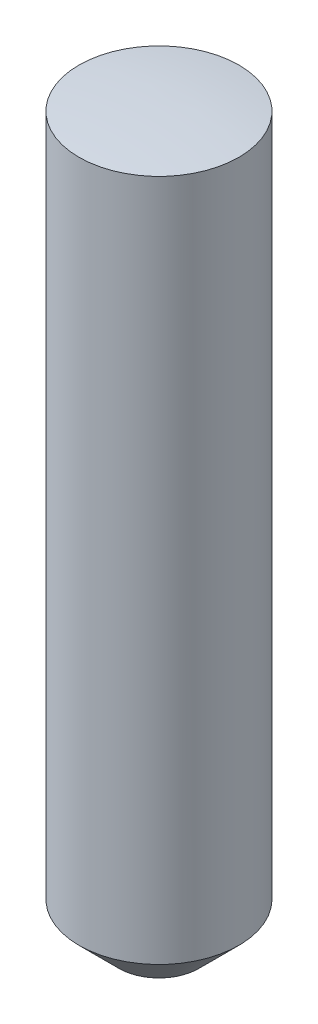
ISO-10303-21;
HEADER;
FILE_DESCRIPTION(('STEP AP214'),'2;1');
FILE_NAME('part.step','',(''),(''),'','','');
FILE_SCHEMA(('AUTOMOTIVE_DESIGN { 1 0 10303 214 1 1 1 1 }'));
ENDSEC;
DATA;
#1=APPLICATION_CONTEXT('core data for automotive mechanical design processes');
#2=APPLICATION_PROTOCOL_DEFINITION('international standard','automotive_design',2000,#1);
#3=PRODUCT_CONTEXT('',#1,'mechanical');
#4=PRODUCT('Part','Part','',(#3));
#5=PRODUCT_RELATED_PRODUCT_CATEGORY('part','',(#4));
#6=PRODUCT_DEFINITION_FORMATION('','',#4);
#7=PRODUCT_DEFINITION_CONTEXT('part definition',#1,'design');
#8=PRODUCT_DEFINITION('design','',#6,#7);
#9=PRODUCT_DEFINITION_SHAPE('','',#8);
#10=(LENGTH_UNIT() NAMED_UNIT(*) SI_UNIT(.MILLI.,.METRE.));
#11=(NAMED_UNIT(*) PLANE_ANGLE_UNIT() SI_UNIT($,.RADIAN.));
#12=(NAMED_UNIT(*) SI_UNIT($,.STERADIAN.) SOLID_ANGLE_UNIT());
#13=UNCERTAINTY_MEASURE_WITH_UNIT(LENGTH_MEASURE(1.E-05),#10,'distance_accuracy_value','');
#14=(GEOMETRIC_REPRESENTATION_CONTEXT(3) GLOBAL_UNCERTAINTY_ASSIGNED_CONTEXT((#13)) GLOBAL_UNIT_ASSIGNED_CONTEXT((#10,
#11,#12)) REPRESENTATION_CONTEXT('',''));
#15=CARTESIAN_POINT('',(0.,0.,0.));
#16=DIRECTION('',(0.,0.,1.));
#17=DIRECTION('',(1.,0.,0.));
#18=AXIS2_PLACEMENT_3D('',#15,#16,#17);
#19=CARTESIAN_POINT('',(0.,-9.1,0.));
#20=DIRECTION('',(0.,1.,0.));
#21=DIRECTION('',(0.,0.,1.));
#22=AXIS2_PLACEMENT_3D('',#19,#20,#21);
#23=CYLINDRICAL_SURFACE('',#22,1.);
#24=CARTESIAN_POINT('',(0.,-8.6,0.));
#25=DIRECTION('',(0.,1.,0.));
#26=DIRECTION('',(0.,0.,1.));
#27=AXIS2_PLACEMENT_3D('',#24,#25,#26);
#28=CIRCLE('',#27,1.);
#29=CARTESIAN_POINT('',(0.,-8.6,1.));
#30=VERTEX_POINT('',#29);
#31=EDGE_CURVE('E41',#30,#30,#28,.T.);
#32=ORIENTED_EDGE('',*,*,#31,.T.);
#33=EDGE_LOOP('',(#32));
#34=FACE_BOUND('',#33,.T.);
#35=CARTESIAN_POINT('',(0.,-0.0627460668062279,0.));
#36=DIRECTION('',(0.,-1.,0.));
#37=DIRECTION('',(0.,0.,-1.));
#38=AXIS2_PLACEMENT_3D('',#35,#36,#37);
#39=CIRCLE('',#38,1.);
#40=CARTESIAN_POINT('',(0.,-0.0627460668062279,-1.));
#41=VERTEX_POINT('',#40);
#42=EDGE_CURVE('E37',#41,#41,#39,.T.);
#43=ORIENTED_EDGE('',*,*,#42,.T.);
#44=EDGE_LOOP('',(#43));
#45=FACE_BOUND('',#44,.T.);
#46=ADVANCED_FACE('F33',(#34,#45),#23,.T.);
#47=CARTESIAN_POINT('',(0.,-9.1,0.));
#48=DIRECTION('',(0.,1.,0.));
#49=DIRECTION('',(0.,0.,1.));
#50=AXIS2_PLACEMENT_3D('',#47,#48,#49);
#51=PLANE('',#50);
#52=CARTESIAN_POINT('',(0.,-9.1,0.));
#53=DIRECTION('',(0.,1.,0.));
#54=DIRECTION('',(0.,0.,1.));
#55=AXIS2_PLACEMENT_3D('',#52,#53,#54);
#56=CIRCLE('',#55,0.499999999999998);
#57=CARTESIAN_POINT('',(0.,-9.1,0.499999999999998));
#58=VERTEX_POINT('',#57);
#59=EDGE_CURVE('E11',#58,#58,#56,.F.);
#60=ORIENTED_EDGE('',*,*,#59,.T.);
#61=EDGE_LOOP('',(#60));
#62=FACE_BOUND('',#61,.T.);
#63=ADVANCED_FACE('F57',(#62),#51,.F.);
#64=CARTESIAN_POINT('',(0.,-8.6,0.));
#65=DIRECTION('',(0.,1.,0.));
#66=DIRECTION('',(0.,0.,1.));
#67=AXIS2_PLACEMENT_3D('',#64,#65,#66);
#68=CONICAL_SURFACE('',#67,1.,0.785398163397452);
#69=ORIENTED_EDGE('',*,*,#59,.F.);
#70=EDGE_LOOP('',(#69));
#71=FACE_BOUND('',#70,.T.);
#72=ORIENTED_EDGE('',*,*,#31,.F.);
#73=EDGE_LOOP('',(#72));
#74=FACE_BOUND('',#73,.T.);
#75=ADVANCED_FACE('F35',(#71,#74),#68,.T.);
#76=CARTESIAN_POINT('',(0.,-8.,0.));
#77=DIRECTION('',(0.,-1.,0.));
#78=DIRECTION('',(-1.,0.,0.));
#79=AXIS2_PLACEMENT_3D('',#76,#77,#78);
#80=SPHERICAL_SURFACE('',#79,8.);
#81=CARTESIAN_POINT('',(0.,0.,0.));
#82=VERTEX_POINT('',#81);
#83=VERTEX_LOOP('',#82);
#84=FACE_BOUND('',#83,.T.);
#85=ORIENTED_EDGE('',*,*,#42,.F.);
#86=EDGE_LOOP('',(#85));
#87=FACE_BOUND('',#86,.T.);
#88=ADVANCED_FACE('F44',(#84,#87),#80,.T.);
#89=CLOSED_SHELL('',(#46,#63,#75,#88));
#90=MANIFOLD_SOLID_BREP('B2',#89);
#91=ADVANCED_BREP_SHAPE_REPRESENTATION('',(#18,#90),#14);
#92=SHAPE_DEFINITION_REPRESENTATION(#9,#91);
ENDSEC;
END-ISO-10303-21;
